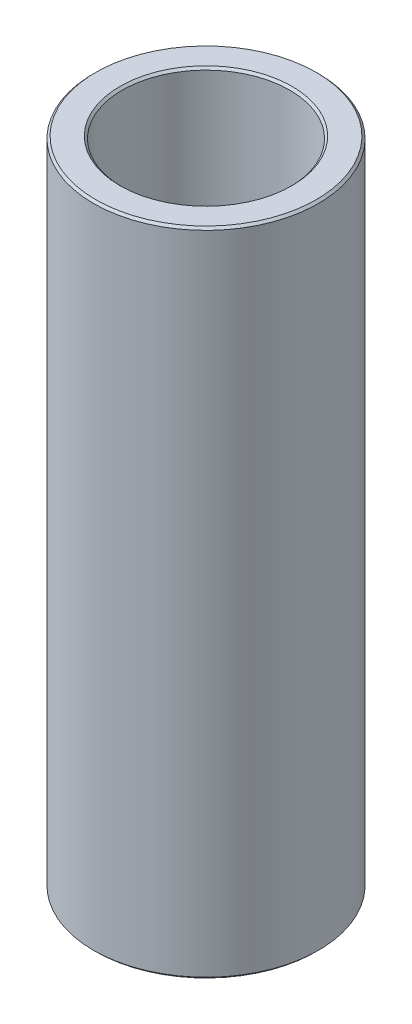
ISO-10303-21;
HEADER;
FILE_DESCRIPTION(('STEP AP214'),'2;1');
FILE_NAME('part.step','',(''),(''),'','','');
FILE_SCHEMA(('AUTOMOTIVE_DESIGN { 1 0 10303 214 1 1 1 1 }'));
ENDSEC;
DATA;
#1=APPLICATION_CONTEXT('core data for automotive mechanical design processes');
#2=APPLICATION_PROTOCOL_DEFINITION('international standard','automotive_design',2000,#1);
#3=PRODUCT_CONTEXT('',#1,'mechanical');
#4=PRODUCT('Part','Part','',(#3));
#5=PRODUCT_RELATED_PRODUCT_CATEGORY('part','',(#4));
#6=PRODUCT_DEFINITION_FORMATION('','',#4);
#7=PRODUCT_DEFINITION_CONTEXT('part definition',#1,'design');
#8=PRODUCT_DEFINITION('design','',#6,#7);
#9=PRODUCT_DEFINITION_SHAPE('','',#8);
#10=(LENGTH_UNIT() NAMED_UNIT(*) SI_UNIT(.MILLI.,.METRE.));
#11=(NAMED_UNIT(*) PLANE_ANGLE_UNIT() SI_UNIT($,.RADIAN.));
#12=(NAMED_UNIT(*) SI_UNIT($,.STERADIAN.) SOLID_ANGLE_UNIT());
#13=UNCERTAINTY_MEASURE_WITH_UNIT(LENGTH_MEASURE(1.E-05),#10,'distance_accuracy_value','');
#14=(GEOMETRIC_REPRESENTATION_CONTEXT(3) GLOBAL_UNCERTAINTY_ASSIGNED_CONTEXT((#13)) GLOBAL_UNIT_ASSIGNED_CONTEXT((#10,
#11,#12)) REPRESENTATION_CONTEXT('',''));
#15=CARTESIAN_POINT('',(0.,0.,0.));
#16=DIRECTION('',(0.,0.,1.));
#17=DIRECTION('',(1.,0.,0.));
#18=AXIS2_PLACEMENT_3D('',#15,#16,#17);
#19=CARTESIAN_POINT('',(0.,246.052624086854,0.));
#20=DIRECTION('',(0.,-1.,0.));
#21=DIRECTION('',(0.,0.,-1.));
#22=AXIS2_PLACEMENT_3D('',#19,#20,#21);
#23=CYLINDRICAL_SURFACE('',#22,42.5);
#24=CARTESIAN_POINT('',(0.,0.832543069740649,0.));
#25=DIRECTION('',(0.,1.,0.));
#26=DIRECTION('',(0.,0.,1.));
#27=AXIS2_PLACEMENT_3D('',#24,#25,#26);
#28=CIRCLE('',#27,42.5);
#29=CARTESIAN_POINT('',(0.,0.832543069740649,42.5));
#30=VERTEX_POINT('',#29);
#31=EDGE_CURVE('E10',#30,#30,#28,.T.);
#32=ORIENTED_EDGE('',*,*,#31,.T.);
#33=EDGE_LOOP('',(#32));
#34=FACE_BOUND('',#33,.T.);
#35=CARTESIAN_POINT('',(0.,245.220081017113,0.));
#36=DIRECTION('',(0.,1.,0.));
#37=DIRECTION('',(0.,0.,1.));
#38=AXIS2_PLACEMENT_3D('',#35,#36,#37);
#39=CIRCLE('',#38,42.5);
#40=CARTESIAN_POINT('',(0.,245.220081017113,42.5));
#41=VERTEX_POINT('',#40);
#42=EDGE_CURVE('E50',#41,#41,#39,.F.);
#43=ORIENTED_EDGE('',*,*,#42,.T.);
#44=EDGE_LOOP('',(#43));
#45=FACE_BOUND('',#44,.T.);
#46=ADVANCED_FACE('F39',(#34,#45),#23,.T.);
#47=CARTESIAN_POINT('',(0.,246.052624086854,0.));
#48=DIRECTION('',(0.,1.,0.));
#49=DIRECTION('',(0.,0.,1.));
#50=AXIS2_PLACEMENT_3D('',#47,#48,#49);
#51=PLANE('',#50);
#52=CARTESIAN_POINT('',(0.,246.052624086854,0.));
#53=DIRECTION('',(0.,1.,0.));
#54=DIRECTION('',(0.,0.,1.));
#55=AXIS2_PLACEMENT_3D('',#52,#53,#54);
#56=CIRCLE('',#55,32.5153725425084);
#57=CARTESIAN_POINT('',(0.,246.052624086854,32.5153725425084));
#58=VERTEX_POINT('',#57);
#59=EDGE_CURVE('E58',#58,#58,#56,.F.);
#60=ORIENTED_EDGE('',*,*,#59,.T.);
#61=EDGE_LOOP('',(#60));
#62=FACE_BOUND('',#61,.T.);
#63=CARTESIAN_POINT('',(0.,246.052624086854,0.));
#64=DIRECTION('',(0.,1.,0.));
#65=DIRECTION('',(0.,0.,1.));
#66=AXIS2_PLACEMENT_3D('',#63,#64,#65);
#67=CIRCLE('',#66,41.6674569302593);
#68=CARTESIAN_POINT('',(0.,246.052624086854,41.6674569302593));
#69=VERTEX_POINT('',#68);
#70=EDGE_CURVE('E61',#69,#69,#67,.T.);
#71=ORIENTED_EDGE('',*,*,#70,.T.);
#72=EDGE_LOOP('',(#71));
#73=FACE_BOUND('',#72,.T.);
#74=ADVANCED_FACE('F88',(#62,#73),#51,.T.);
#75=CARTESIAN_POINT('',(0.,0.,0.));
#76=DIRECTION('',(0.,1.,0.));
#77=DIRECTION('',(0.,0.,1.));
#78=AXIS2_PLACEMENT_3D('',#75,#76,#77);
#79=PLANE('',#78);
#80=CARTESIAN_POINT('',(0.,0.,0.));
#81=DIRECTION('',(0.,1.,0.));
#82=DIRECTION('',(0.,0.,1.));
#83=AXIS2_PLACEMENT_3D('',#80,#81,#82);
#84=CIRCLE('',#83,32.5153725425084);
#85=CARTESIAN_POINT('',(0.,0.,32.5153725425084));
#86=VERTEX_POINT('',#85);
#87=EDGE_CURVE('E51',#86,#86,#84,.T.);
#88=ORIENTED_EDGE('',*,*,#87,.T.);
#89=EDGE_LOOP('',(#88));
#90=FACE_BOUND('',#89,.T.);
#91=CARTESIAN_POINT('',(0.,0.,0.));
#92=DIRECTION('',(0.,1.,0.));
#93=DIRECTION('',(0.,0.,1.));
#94=AXIS2_PLACEMENT_3D('',#91,#92,#93);
#95=CIRCLE('',#94,41.6674569302594);
#96=CARTESIAN_POINT('',(0.,0.,41.6674569302594));
#97=VERTEX_POINT('',#96);
#98=EDGE_CURVE('E54',#97,#97,#95,.F.);
#99=ORIENTED_EDGE('',*,*,#98,.T.);
#100=EDGE_LOOP('',(#99));
#101=FACE_BOUND('',#100,.T.);
#102=ADVANCED_FACE('F83',(#90,#101),#79,.F.);
#103=CARTESIAN_POINT('',(0.,246.052624086854,0.));
#104=DIRECTION('',(0.,-1.,0.));
#105=DIRECTION('',(0.,0.,-1.));
#106=AXIS2_PLACEMENT_3D('',#103,#104,#105);
#107=CYLINDRICAL_SURFACE('',#106,31.6828294727678);
#108=CARTESIAN_POINT('',(0.,245.220081017113,0.));
#109=DIRECTION('',(0.,1.,0.));
#110=DIRECTION('',(0.,0.,1.));
#111=AXIS2_PLACEMENT_3D('',#108,#109,#110);
#112=CIRCLE('',#111,31.6828294727678);
#113=CARTESIAN_POINT('',(0.,245.220081017113,31.6828294727677));
#114=VERTEX_POINT('',#113);
#115=EDGE_CURVE('E67',#114,#114,#112,.T.);
#116=ORIENTED_EDGE('',*,*,#115,.T.);
#117=EDGE_LOOP('',(#116));
#118=FACE_BOUND('',#117,.T.);
#119=CARTESIAN_POINT('',(0.,0.832543069740649,0.));
#120=DIRECTION('',(0.,1.,0.));
#121=DIRECTION('',(0.,0.,1.));
#122=AXIS2_PLACEMENT_3D('',#119,#120,#121);
#123=CIRCLE('',#122,31.6828294727678);
#124=CARTESIAN_POINT('',(0.,0.832543069740649,31.6828294727678));
#125=VERTEX_POINT('',#124);
#126=EDGE_CURVE('E69',#125,#125,#123,.F.);
#127=ORIENTED_EDGE('',*,*,#126,.T.);
#128=EDGE_LOOP('',(#127));
#129=FACE_BOUND('',#128,.T.);
#130=ADVANCED_FACE('F71',(#118,#129),#107,.F.);
#131=CARTESIAN_POINT('',(0.,245.220081017113,0.));
#132=DIRECTION('',(0.,1.,0.));
#133=DIRECTION('',(0.,0.,1.));
#134=AXIS2_PLACEMENT_3D('',#131,#132,#133);
#135=CONICAL_SURFACE('',#134,31.6828294727678,0.78539816339744);
#136=CARTESIAN_POINT('',(0.,246.052624086854,32.5153725425084));
#137=CARTESIAN_POINT('',(0.,246.043951763211,32.5067002188653));
#138=CARTESIAN_POINT('',(0.,246.035279439567,32.4980278952222));
#139=CARTESIAN_POINT('',(0.,246.017934792281,32.4806832479359));
#140=CARTESIAN_POINT('',(0.,246.009262468638,32.4720109242928));
#141=CARTESIAN_POINT('',(0.,245.991917821352,32.4546662770065));
#142=CARTESIAN_POINT('',(0.,245.983245497709,32.4459939533634));
#143=CARTESIAN_POINT('',(0.,245.965900850422,32.4286493060771));
#144=CARTESIAN_POINT('',(0.,245.957228526779,32.419976982434));
#145=CARTESIAN_POINT('',(0.,245.939883879493,32.4026323351477));
#146=CARTESIAN_POINT('',(0.,245.93121155585,32.3939600115046));
#147=CARTESIAN_POINT('',(0.,245.913866908564,32.3766153642183));
#148=CARTESIAN_POINT('',(0.,245.90519458492,32.3679430405752));
#149=CARTESIAN_POINT('',(0.,245.887849937634,32.3505983932889));
#150=CARTESIAN_POINT('',(0.,245.879177613991,32.3419260696458));
#151=CARTESIAN_POINT('',(0.,245.861832966705,32.3245814223595));
#152=CARTESIAN_POINT('',(0.,245.853160643062,32.3159090987164));
#153=CARTESIAN_POINT('',(0.,245.835815995775,32.2985644514301));
#154=CARTESIAN_POINT('',(0.,245.827143672132,32.289892127787));
#155=CARTESIAN_POINT('',(0.,245.809799024846,32.2725474805007));
#156=CARTESIAN_POINT('',(0.,245.801126701203,32.2638751568576));
#157=CARTESIAN_POINT('',(0.,245.783782053917,32.2465305095713));
#158=CARTESIAN_POINT('',(0.,245.775109730273,32.2378581859282));
#159=CARTESIAN_POINT('',(0.,245.757765082987,32.2205135386419));
#160=CARTESIAN_POINT('',(0.,245.749092759344,32.2118412149988));
#161=CARTESIAN_POINT('',(0.,245.731748112058,32.1944965677125));
#162=CARTESIAN_POINT('',(0.,245.723075788415,32.1858242440694));
#163=CARTESIAN_POINT('',(0.,245.705731141128,32.1684795967831));
#164=CARTESIAN_POINT('',(0.,245.697058817485,32.15980727314));
#165=CARTESIAN_POINT('',(0.,245.679714170199,32.1424626258537));
#166=CARTESIAN_POINT('',(0.,245.671041846556,32.1337903022106));
#167=CARTESIAN_POINT('',(0.,245.65369719927,32.1164456549243));
#168=CARTESIAN_POINT('',(0.,245.645024875626,32.1077733312812));
#169=CARTESIAN_POINT('',(0.,245.62768022834,32.090428683995));
#170=CARTESIAN_POINT('',(0.,245.619007904697,32.0817563603518));
#171=CARTESIAN_POINT('',(0.,245.601663257411,32.0644117130656));
#172=CARTESIAN_POINT('',(0.,245.592990933768,32.0557393894224));
#173=CARTESIAN_POINT('',(0.,245.575646286481,32.0383947421362));
#174=CARTESIAN_POINT('',(0.,245.566973962838,32.029722418493));
#175=CARTESIAN_POINT('',(0.,245.549629315552,32.0123777712068));
#176=CARTESIAN_POINT('',(0.,245.540956991909,32.0037054475636));
#177=CARTESIAN_POINT('',(0.,245.523612344623,31.9863608002774));
#178=CARTESIAN_POINT('',(0.,245.514940020979,31.9776884766342));
#179=CARTESIAN_POINT('',(0.,245.497595373693,31.960343829348));
#180=CARTESIAN_POINT('',(0.,245.48892305005,31.9516715057048));
#181=CARTESIAN_POINT('',(0.,245.471578402764,31.9343268584186));
#182=CARTESIAN_POINT('',(0.,245.462906079121,31.9256545347754));
#183=CARTESIAN_POINT('',(0.,245.445561431834,31.9083098874892));
#184=CARTESIAN_POINT('',(0.,245.436889108191,31.899637563846));
#185=CARTESIAN_POINT('',(0.,245.419544460905,31.8822929165598));
#186=CARTESIAN_POINT('',(0.,245.410872137262,31.8736205929166));
#187=CARTESIAN_POINT('',(0.,245.393527489976,31.8562759456304));
#188=CARTESIAN_POINT('',(0.,245.384855166333,31.8476036219872));
#189=CARTESIAN_POINT('',(0.,245.367510519046,31.830258974701));
#190=CARTESIAN_POINT('',(0.,245.358838195403,31.8215866510579));
#191=CARTESIAN_POINT('',(0.,245.341493548117,31.8042420037716));
#192=CARTESIAN_POINT('',(0.,245.332821224474,31.7955696801284));
#193=CARTESIAN_POINT('',(0.,245.315476577187,31.7782250328422));
#194=CARTESIAN_POINT('',(0.,245.306804253544,31.7695527091991));
#195=CARTESIAN_POINT('',(0.,245.289459606258,31.7522080619128));
#196=CARTESIAN_POINT('',(0.,245.280787282615,31.7435357382697));
#197=CARTESIAN_POINT('',(0.,245.263442635329,31.7261910909834));
#198=CARTESIAN_POINT('',(0.,245.254770311686,31.7175187673403));
#199=CARTESIAN_POINT('',(0.,245.237425664399,31.700174120054));
#200=CARTESIAN_POINT('',(0.,245.228753340756,31.6915017964109));
#201=CARTESIAN_POINT('',(0.,245.220081017113,31.6828294727677));
#202=B_SPLINE_CURVE_WITH_KNOTS('',3,(#136,#137,#138,#139,#140,#141,#142,#143,#144,#145,#146,
#147,#148,#149,#150,#151,#152,#153,#154,#155,#156,#157,#158,#159,#160,#161,#162,#163,#164,#165,
#166,#167,#168,#169,#170,#171,#172,#173,#174,#175,#176,#177,#178,#179,#180,#181,#182,#183,#184,
#185,#186,#187,#188,#189,#190,#191,#192,#193,#194,#195,#196,#197,#198,#199,#200,#201),
.UNSPECIFIED.,.F.,.F.,(4,2,2,2,2,2,2,2,2,2,2,2,2,2,2,2,2,2,2,2,2,2,2,2,2,2,2,2,2,2,2,2,4),(0.,
0.0367935531402284,0.0735871062804568,0.110380659420666,0.147174212560894,0.183967765701103,
0.220761318841331,0.25755487198154,0.294348425121768,0.331141978261982,0.36793553140221,
0.404729084542419,0.441522637682647,0.478316190822856,0.515109743963085,0.551903297103293,
0.588696850243522,0.62549040338375,0.662283956523959,0.699077509664187,0.735871062804396,
0.772664615944625,0.809458169084833,0.846251722225062,0.883045275365275,0.919838828505504,
0.956632381645713,0.993425934785941,1.03021948792615,1.06701304106638,1.10380659420659,
1.14060014734682,1.17739370048702),.UNSPECIFIED.);
#203=EDGE_CURVE('BSEAM77',#58,#114,#202,.T.);
#204=ORIENTED_EDGE('',*,*,#59,.F.);
#205=ORIENTED_EDGE('',*,*,#115,.F.);
#206=ORIENTED_EDGE('',*,*,#203,.T.);
#207=ORIENTED_EDGE('',*,*,#203,.F.);
#208=EDGE_LOOP('',(#204,#206,#205,#207));
#209=FACE_BOUND('',#208,.T.);
#210=ADVANCED_FACE('F77',(#209),#135,.F.);
#211=CARTESIAN_POINT('',(0.,0.,0.));
#212=DIRECTION('',(0.,-1.,0.));
#213=DIRECTION('',(0.,0.,-1.));
#214=AXIS2_PLACEMENT_3D('',#211,#212,#213);
#215=CONICAL_SURFACE('',#214,32.5153725425084,0.785398163397457);
#216=ORIENTED_EDGE('',*,*,#126,.F.);
#217=EDGE_LOOP('',(#216));
#218=FACE_BOUND('',#217,.T.);
#219=ORIENTED_EDGE('',*,*,#87,.F.);
#220=EDGE_LOOP('',(#219));
#221=FACE_BOUND('',#220,.T.);
#222=ADVANCED_FACE('F73',(#218,#221),#215,.F.);
#223=CARTESIAN_POINT('',(0.,0.832543069740649,0.));
#224=DIRECTION('',(0.,1.,0.));
#225=DIRECTION('',(0.,0.,1.));
#226=AXIS2_PLACEMENT_3D('',#223,#224,#225);
#227=CONICAL_SURFACE('',#226,42.5,0.785398163397448);
#228=ORIENTED_EDGE('',*,*,#98,.F.);
#229=EDGE_LOOP('',(#228));
#230=FACE_BOUND('',#229,.T.);
#231=ORIENTED_EDGE('',*,*,#31,.F.);
#232=EDGE_LOOP('',(#231));
#233=FACE_BOUND('',#232,.T.);
#234=ADVANCED_FACE('F76',(#230,#233),#227,.T.);
#235=CARTESIAN_POINT('',(0.,246.052624086854,0.));
#236=DIRECTION('',(0.,-1.,0.));
#237=DIRECTION('',(0.,0.,-1.));
#238=AXIS2_PLACEMENT_3D('',#235,#236,#237);
#239=CONICAL_SURFACE('',#238,41.6674569302593,0.785398163397465);
#240=ORIENTED_EDGE('',*,*,#42,.F.);
#241=EDGE_LOOP('',(#240));
#242=FACE_BOUND('',#241,.T.);
#243=ORIENTED_EDGE('',*,*,#70,.F.);
#244=EDGE_LOOP('',(#243));
#245=FACE_BOUND('',#244,.T.);
#246=ADVANCED_FACE('F45',(#242,#245),#239,.T.);
#247=CLOSED_SHELL('',(#46,#74,#102,#130,#210,#222,#234,#246));
#248=MANIFOLD_SOLID_BREP('B2',#247);
#249=ADVANCED_BREP_SHAPE_REPRESENTATION('',(#18,#248),#14);
#250=SHAPE_DEFINITION_REPRESENTATION(#9,#249);
ENDSEC;
END-ISO-10303-21;
